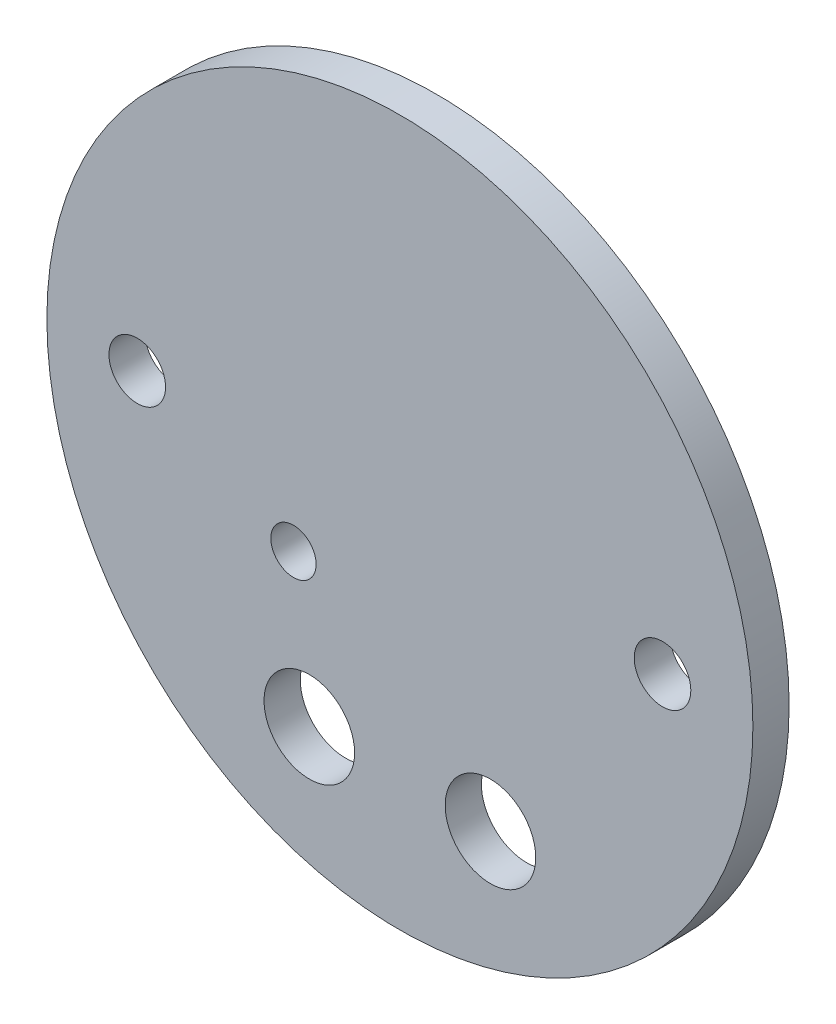
ISO-10303-21;
HEADER;
FILE_DESCRIPTION(('STEP AP214'),'2;1');
FILE_NAME('part.step','',(''),(''),'','','');
FILE_SCHEMA(('AUTOMOTIVE_DESIGN { 1 0 10303 214 1 1 1 1 }'));
ENDSEC;
DATA;
#1=APPLICATION_CONTEXT('core data for automotive mechanical design processes');
#2=APPLICATION_PROTOCOL_DEFINITION('international standard','automotive_design',2000,#1);
#3=PRODUCT_CONTEXT('',#1,'mechanical');
#4=PRODUCT('Part','Part','',(#3));
#5=PRODUCT_RELATED_PRODUCT_CATEGORY('part','',(#4));
#6=PRODUCT_DEFINITION_FORMATION('','',#4);
#7=PRODUCT_DEFINITION_CONTEXT('part definition',#1,'design');
#8=PRODUCT_DEFINITION('design','',#6,#7);
#9=PRODUCT_DEFINITION_SHAPE('','',#8);
#10=(LENGTH_UNIT() NAMED_UNIT(*) SI_UNIT(.MILLI.,.METRE.));
#11=(NAMED_UNIT(*) PLANE_ANGLE_UNIT() SI_UNIT($,.RADIAN.));
#12=(NAMED_UNIT(*) SI_UNIT($,.STERADIAN.) SOLID_ANGLE_UNIT());
#13=UNCERTAINTY_MEASURE_WITH_UNIT(LENGTH_MEASURE(1.E-05),#10,'distance_accuracy_value','');
#14=(GEOMETRIC_REPRESENTATION_CONTEXT(3) GLOBAL_UNCERTAINTY_ASSIGNED_CONTEXT((#13)) GLOBAL_UNIT_ASSIGNED_CONTEXT((#10,
#11,#12)) REPRESENTATION_CONTEXT('',''));
#15=CARTESIAN_POINT('',(0.,0.,0.));
#16=DIRECTION('',(0.,0.,1.));
#17=DIRECTION('',(1.,0.,0.));
#18=AXIS2_PLACEMENT_3D('',#15,#16,#17);
#19=CARTESIAN_POINT('',(-12.7,-31.1667936271924,0.));
#20=DIRECTION('',(0.,0.,1.));
#21=DIRECTION('',(1.,0.,0.));
#22=AXIS2_PLACEMENT_3D('',#19,#20,#21);
#23=CYLINDRICAL_SURFACE('',#22,6.35);
#24=CARTESIAN_POINT('',(-12.7,-31.1667936271924,0.));
#25=DIRECTION('',(0.,0.,1.));
#26=DIRECTION('',(1.,0.,0.));
#27=AXIS2_PLACEMENT_3D('',#24,#25,#26);
#28=CIRCLE('',#27,6.35);
#29=CARTESIAN_POINT('',(-6.35,-31.1667936271924,0.));
#30=VERTEX_POINT('',#29);
#31=EDGE_CURVE('E45',#30,#30,#28,.T.);
#32=ORIENTED_EDGE('',*,*,#31,.F.);
#33=EDGE_LOOP('',(#32));
#34=FACE_BOUND('',#33,.T.);
#35=CARTESIAN_POINT('',(-12.7,-31.1667936271924,5.08));
#36=DIRECTION('',(0.,0.,1.));
#37=DIRECTION('',(1.,0.,0.));
#38=AXIS2_PLACEMENT_3D('',#35,#36,#37);
#39=CIRCLE('',#38,6.35);
#40=CARTESIAN_POINT('',(-6.35,-31.1667936271924,5.08));
#41=VERTEX_POINT('',#40);
#42=EDGE_CURVE('E59',#41,#41,#39,.F.);
#43=ORIENTED_EDGE('',*,*,#42,.F.);
#44=EDGE_LOOP('',(#43));
#45=FACE_BOUND('',#44,.T.);
#46=ADVANCED_FACE('F32',(#34,#45),#23,.F.);
#47=CARTESIAN_POINT('',(-14.9213454566843,-10.9685752809603,0.));
#48=DIRECTION('',(0.,0.,1.));
#49=DIRECTION('',(1.,0.,0.));
#50=AXIS2_PLACEMENT_3D('',#47,#48,#49);
#51=CYLINDRICAL_SURFACE('',#50,3.175);
#52=CARTESIAN_POINT('',(-14.9213454566843,-10.9685752809603,0.));
#53=DIRECTION('',(0.,0.,1.));
#54=DIRECTION('',(1.,0.,0.));
#55=AXIS2_PLACEMENT_3D('',#52,#53,#54);
#56=CIRCLE('',#55,3.175);
#57=CARTESIAN_POINT('',(-11.7463454566843,-10.9685752809603,0.));
#58=VERTEX_POINT('',#57);
#59=EDGE_CURVE('E56',#58,#58,#56,.T.);
#60=ORIENTED_EDGE('',*,*,#59,.F.);
#61=EDGE_LOOP('',(#60));
#62=FACE_BOUND('',#61,.T.);
#63=CARTESIAN_POINT('',(-14.9213454566843,-10.9685752809603,5.08));
#64=DIRECTION('',(0.,0.,1.));
#65=DIRECTION('',(1.,0.,0.));
#66=AXIS2_PLACEMENT_3D('',#63,#64,#65);
#67=CIRCLE('',#66,3.175);
#68=CARTESIAN_POINT('',(-11.7463454566843,-10.9685752809603,5.08));
#69=VERTEX_POINT('',#68);
#70=EDGE_CURVE('E64',#69,#69,#67,.F.);
#71=ORIENTED_EDGE('',*,*,#70,.F.);
#72=EDGE_LOOP('',(#71));
#73=FACE_BOUND('',#72,.T.);
#74=ADVANCED_FACE('F95',(#62,#73),#51,.F.);
#75=CARTESIAN_POINT('',(36.83,0.,0.));
#76=DIRECTION('',(0.,0.,1.));
#77=DIRECTION('',(1.,0.,0.));
#78=AXIS2_PLACEMENT_3D('',#75,#76,#77);
#79=CYLINDRICAL_SURFACE('',#78,3.96875);
#80=CARTESIAN_POINT('',(36.83,0.,0.));
#81=DIRECTION('',(0.,0.,1.));
#82=DIRECTION('',(1.,0.,0.));
#83=AXIS2_PLACEMENT_3D('',#80,#81,#82);
#84=CIRCLE('',#83,3.96875);
#85=CARTESIAN_POINT('',(40.79875,0.,0.));
#86=VERTEX_POINT('',#85);
#87=EDGE_CURVE('E53',#86,#86,#84,.T.);
#88=ORIENTED_EDGE('',*,*,#87,.F.);
#89=EDGE_LOOP('',(#88));
#90=FACE_BOUND('',#89,.T.);
#91=CARTESIAN_POINT('',(36.83,0.,5.08));
#92=DIRECTION('',(0.,0.,1.));
#93=DIRECTION('',(1.,0.,0.));
#94=AXIS2_PLACEMENT_3D('',#91,#92,#93);
#95=CIRCLE('',#94,3.96875);
#96=CARTESIAN_POINT('',(40.79875,0.,5.08));
#97=VERTEX_POINT('',#96);
#98=EDGE_CURVE('E67',#97,#97,#95,.F.);
#99=ORIENTED_EDGE('',*,*,#98,.F.);
#100=EDGE_LOOP('',(#99));
#101=FACE_BOUND('',#100,.T.);
#102=ADVANCED_FACE('F89',(#90,#101),#79,.F.);
#103=CARTESIAN_POINT('',(-36.83,0.,0.));
#104=DIRECTION('',(0.,0.,1.));
#105=DIRECTION('',(1.,0.,0.));
#106=AXIS2_PLACEMENT_3D('',#103,#104,#105);
#107=CYLINDRICAL_SURFACE('',#106,3.96875);
#108=CARTESIAN_POINT('',(-36.83,0.,0.));
#109=DIRECTION('',(0.,0.,1.));
#110=DIRECTION('',(1.,0.,0.));
#111=AXIS2_PLACEMENT_3D('',#108,#109,#110);
#112=CIRCLE('',#111,3.96875);
#113=CARTESIAN_POINT('',(-32.86125,0.,0.));
#114=VERTEX_POINT('',#113);
#115=EDGE_CURVE('E50',#114,#114,#112,.T.);
#116=ORIENTED_EDGE('',*,*,#115,.F.);
#117=EDGE_LOOP('',(#116));
#118=FACE_BOUND('',#117,.T.);
#119=CARTESIAN_POINT('',(-36.83,0.,5.08));
#120=DIRECTION('',(0.,0.,1.));
#121=DIRECTION('',(1.,0.,0.));
#122=AXIS2_PLACEMENT_3D('',#119,#120,#121);
#123=CIRCLE('',#122,3.96875);
#124=CARTESIAN_POINT('',(-32.86125,0.,5.08));
#125=VERTEX_POINT('',#124);
#126=EDGE_CURVE('E70',#125,#125,#123,.F.);
#127=ORIENTED_EDGE('',*,*,#126,.F.);
#128=EDGE_LOOP('',(#127));
#129=FACE_BOUND('',#128,.T.);
#130=ADVANCED_FACE('F81',(#118,#129),#107,.F.);
#131=CARTESIAN_POINT('',(12.7,-31.1667936271924,0.));
#132=DIRECTION('',(0.,0.,1.));
#133=DIRECTION('',(1.,0.,0.));
#134=AXIS2_PLACEMENT_3D('',#131,#132,#133);
#135=CYLINDRICAL_SURFACE('',#134,6.35);
#136=CARTESIAN_POINT('',(12.7,-31.1667936271924,0.));
#137=DIRECTION('',(0.,0.,1.));
#138=DIRECTION('',(1.,0.,0.));
#139=AXIS2_PLACEMENT_3D('',#136,#137,#138);
#140=CIRCLE('',#139,6.35);
#141=CARTESIAN_POINT('',(19.05,-31.1667936271924,0.));
#142=VERTEX_POINT('',#141);
#143=EDGE_CURVE('E49',#142,#142,#140,.T.);
#144=ORIENTED_EDGE('',*,*,#143,.F.);
#145=EDGE_LOOP('',(#144));
#146=FACE_BOUND('',#145,.T.);
#147=CARTESIAN_POINT('',(12.7,-31.1667936271924,5.08));
#148=DIRECTION('',(0.,0.,1.));
#149=DIRECTION('',(1.,0.,0.));
#150=AXIS2_PLACEMENT_3D('',#147,#148,#149);
#151=CIRCLE('',#150,6.35);
#152=CARTESIAN_POINT('',(19.05,-31.1667936271924,5.08));
#153=VERTEX_POINT('',#152);
#154=EDGE_CURVE('E36',#153,#153,#151,.F.);
#155=ORIENTED_EDGE('',*,*,#154,.F.);
#156=EDGE_LOOP('',(#155));
#157=FACE_BOUND('',#156,.T.);
#158=ADVANCED_FACE('F79',(#146,#157),#135,.F.);
#159=CARTESIAN_POINT('',(0.,0.,5.08));
#160=DIRECTION('',(0.,0.,-1.));
#161=DIRECTION('',(-1.,0.,0.));
#162=AXIS2_PLACEMENT_3D('',#159,#160,#161);
#163=CYLINDRICAL_SURFACE('',#162,49.5046);
#164=CARTESIAN_POINT('',(0.,0.,5.08));
#165=DIRECTION('',(0.,0.,1.));
#166=DIRECTION('',(1.,0.,0.));
#167=AXIS2_PLACEMENT_3D('',#164,#165,#166);
#168=CIRCLE('',#167,49.5046);
#169=CARTESIAN_POINT('',(49.5046,0.,5.08));
#170=VERTEX_POINT('',#169);
#171=EDGE_CURVE('E10',#170,#170,#168,.T.);
#172=ORIENTED_EDGE('',*,*,#171,.F.);
#173=EDGE_LOOP('',(#172));
#174=FACE_BOUND('',#173,.T.);
#175=CARTESIAN_POINT('',(0.,0.,0.));
#176=DIRECTION('',(0.,0.,1.));
#177=DIRECTION('',(1.,0.,0.));
#178=AXIS2_PLACEMENT_3D('',#175,#176,#177);
#179=CIRCLE('',#178,49.5046);
#180=CARTESIAN_POINT('',(49.5046,0.,0.));
#181=VERTEX_POINT('',#180);
#182=EDGE_CURVE('E40',#181,#181,#179,.T.);
#183=ORIENTED_EDGE('',*,*,#182,.T.);
#184=EDGE_LOOP('',(#183));
#185=FACE_BOUND('',#184,.T.);
#186=ADVANCED_FACE('F34',(#174,#185),#163,.T.);
#187=CARTESIAN_POINT('',(0.,0.,5.08));
#188=DIRECTION('',(0.,0.,1.));
#189=DIRECTION('',(1.,0.,0.));
#190=AXIS2_PLACEMENT_3D('',#187,#188,#189);
#191=PLANE('',#190);
#192=ORIENTED_EDGE('',*,*,#171,.T.);
#193=EDGE_LOOP('',(#192));
#194=FACE_BOUND('',#193,.T.);
#195=ORIENTED_EDGE('',*,*,#42,.T.);
#196=EDGE_LOOP('',(#195));
#197=FACE_BOUND('',#196,.T.);
#198=ORIENTED_EDGE('',*,*,#70,.T.);
#199=EDGE_LOOP('',(#198));
#200=FACE_BOUND('',#199,.T.);
#201=ORIENTED_EDGE('',*,*,#98,.T.);
#202=EDGE_LOOP('',(#201));
#203=FACE_BOUND('',#202,.T.);
#204=ORIENTED_EDGE('',*,*,#126,.T.);
#205=EDGE_LOOP('',(#204));
#206=FACE_BOUND('',#205,.T.);
#207=ORIENTED_EDGE('',*,*,#154,.T.);
#208=EDGE_LOOP('',(#207));
#209=FACE_BOUND('',#208,.T.);
#210=ADVANCED_FACE('F77',(#194,#197,#200,#203,#206,#209),#191,.T.);
#211=CARTESIAN_POINT('',(0.,0.,0.));
#212=DIRECTION('',(0.,0.,1.));
#213=DIRECTION('',(1.,0.,0.));
#214=AXIS2_PLACEMENT_3D('',#211,#212,#213);
#215=PLANE('',#214);
#216=ORIENTED_EDGE('',*,*,#143,.T.);
#217=EDGE_LOOP('',(#216));
#218=FACE_BOUND('',#217,.T.);
#219=ORIENTED_EDGE('',*,*,#115,.T.);
#220=EDGE_LOOP('',(#219));
#221=FACE_BOUND('',#220,.T.);
#222=ORIENTED_EDGE('',*,*,#87,.T.);
#223=EDGE_LOOP('',(#222));
#224=FACE_BOUND('',#223,.T.);
#225=ORIENTED_EDGE('',*,*,#59,.T.);
#226=EDGE_LOOP('',(#225));
#227=FACE_BOUND('',#226,.T.);
#228=ORIENTED_EDGE('',*,*,#31,.T.);
#229=EDGE_LOOP('',(#228));
#230=FACE_BOUND('',#229,.T.);
#231=ORIENTED_EDGE('',*,*,#182,.F.);
#232=EDGE_LOOP('',(#231));
#233=FACE_BOUND('',#232,.T.);
#234=ADVANCED_FACE('F106',(#218,#221,#224,#227,#230,#233),#215,.F.);
#235=CLOSED_SHELL('',(#46,#74,#102,#130,#158,#186,#210,#234));
#236=MANIFOLD_SOLID_BREP('B2',#235);
#237=ADVANCED_BREP_SHAPE_REPRESENTATION('',(#18,#236),#14);
#238=SHAPE_DEFINITION_REPRESENTATION(#9,#237);
ENDSEC;
END-ISO-10303-21;
